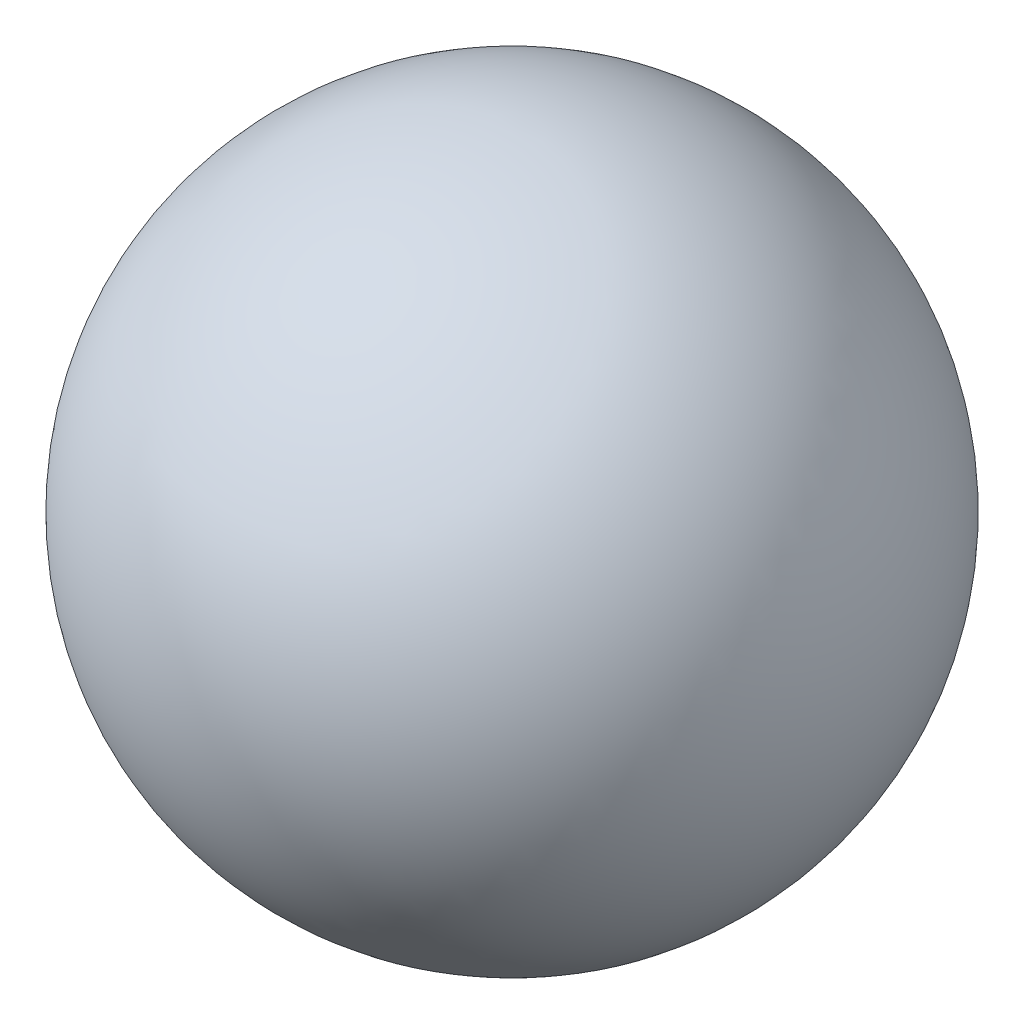
ISO-10303-21;
HEADER;
FILE_DESCRIPTION(('STEP AP214'),'2;1');
FILE_NAME('part.step','',(''),(''),'','','');
FILE_SCHEMA(('AUTOMOTIVE_DESIGN { 1 0 10303 214 1 1 1 1 }'));
ENDSEC;
DATA;
#1=APPLICATION_CONTEXT('core data for automotive mechanical design processes');
#2=APPLICATION_PROTOCOL_DEFINITION('international standard','automotive_design',2000,#1);
#3=PRODUCT_CONTEXT('',#1,'mechanical');
#4=PRODUCT('Part','Part','',(#3));
#5=PRODUCT_RELATED_PRODUCT_CATEGORY('part','',(#4));
#6=PRODUCT_DEFINITION_FORMATION('','',#4);
#7=PRODUCT_DEFINITION_CONTEXT('part definition',#1,'design');
#8=PRODUCT_DEFINITION('design','',#6,#7);
#9=PRODUCT_DEFINITION_SHAPE('','',#8);
#10=(LENGTH_UNIT() NAMED_UNIT(*) SI_UNIT(.MILLI.,.METRE.));
#11=(NAMED_UNIT(*) PLANE_ANGLE_UNIT() SI_UNIT($,.RADIAN.));
#12=(NAMED_UNIT(*) SI_UNIT($,.STERADIAN.) SOLID_ANGLE_UNIT());
#13=UNCERTAINTY_MEASURE_WITH_UNIT(LENGTH_MEASURE(1.E-05),#10,'distance_accuracy_value','');
#14=(GEOMETRIC_REPRESENTATION_CONTEXT(3) GLOBAL_UNCERTAINTY_ASSIGNED_CONTEXT((#13)) GLOBAL_UNIT_ASSIGNED_CONTEXT((#10,
#11,#12)) REPRESENTATION_CONTEXT('',''));
#15=CARTESIAN_POINT('',(0.,0.,0.));
#16=DIRECTION('',(0.,0.,1.));
#17=DIRECTION('',(1.,0.,0.));
#18=AXIS2_PLACEMENT_3D('',#15,#16,#17);
#19=CARTESIAN_POINT('',(0.,0.,0.));
#20=DIRECTION('',(0.,-1.,0.));
#21=DIRECTION('',(0.,0.,1.));
#22=AXIS2_PLACEMENT_3D('',#19,#20,#21);
#23=SPHERICAL_SURFACE('',#22,7.00000000000001);
#24=CARTESIAN_POINT('',(0.,-7.00000000000003,0.));
#25=VERTEX_POINT('',#24);
#26=VERTEX_LOOP('',#25);
#27=FACE_BOUND('',#26,.T.);
#28=ADVANCED_FACE('F39',(#27),#23,.T.);
#29=CLOSED_SHELL('',(#28));
#30=MANIFOLD_SOLID_BREP('B2',#29);
#31=ADVANCED_BREP_SHAPE_REPRESENTATION('',(#18,#30),#14);
#32=SHAPE_DEFINITION_REPRESENTATION(#9,#31);
ENDSEC;
END-ISO-10303-21;
